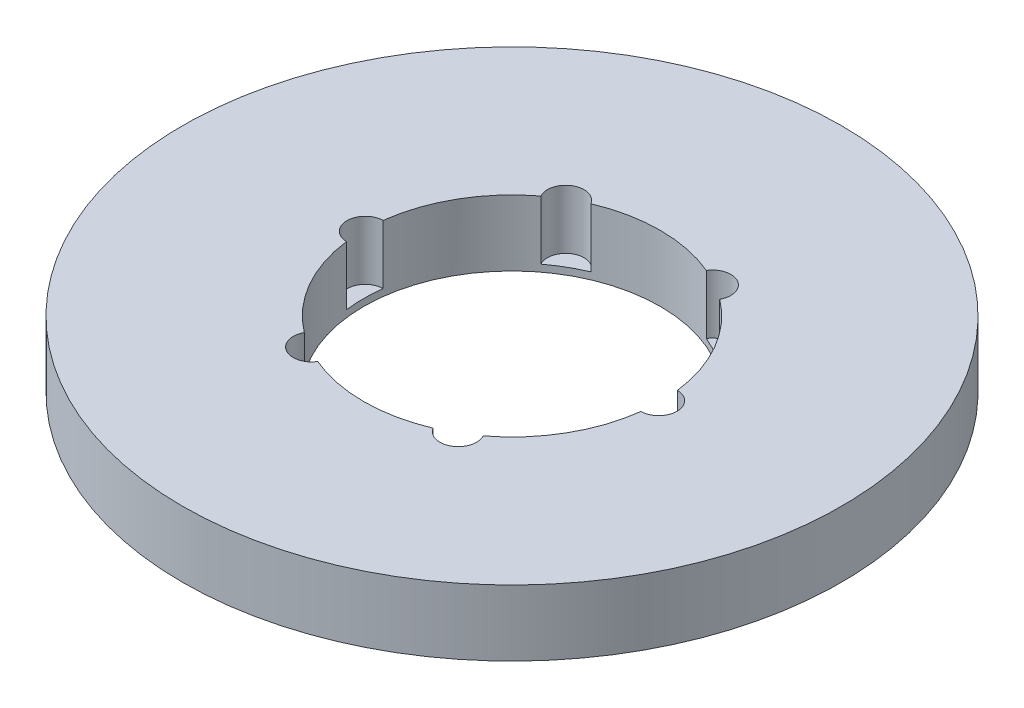
ISO-10303-21;
HEADER;
FILE_DESCRIPTION(('STEP AP214'),'2;1');
FILE_NAME('part.step','',(''),(''),'','','');
FILE_SCHEMA(('AUTOMOTIVE_DESIGN { 1 0 10303 214 1 1 1 1 }'));
ENDSEC;
DATA;
#1=APPLICATION_CONTEXT('core data for automotive mechanical design processes');
#2=APPLICATION_PROTOCOL_DEFINITION('international standard','automotive_design',2000,#1);
#3=PRODUCT_CONTEXT('',#1,'mechanical');
#4=PRODUCT('Part','Part','',(#3));
#5=PRODUCT_RELATED_PRODUCT_CATEGORY('part','',(#4));
#6=PRODUCT_DEFINITION_FORMATION('','',#4);
#7=PRODUCT_DEFINITION_CONTEXT('part definition',#1,'design');
#8=PRODUCT_DEFINITION('design','',#6,#7);
#9=PRODUCT_DEFINITION_SHAPE('','',#8);
#10=(LENGTH_UNIT() NAMED_UNIT(*) SI_UNIT(.MILLI.,.METRE.));
#11=(NAMED_UNIT(*) PLANE_ANGLE_UNIT() SI_UNIT($,.RADIAN.));
#12=(NAMED_UNIT(*) SI_UNIT($,.STERADIAN.) SOLID_ANGLE_UNIT());
#13=UNCERTAINTY_MEASURE_WITH_UNIT(LENGTH_MEASURE(1.E-05),#10,'distance_accuracy_value','');
#14=(GEOMETRIC_REPRESENTATION_CONTEXT(3) GLOBAL_UNCERTAINTY_ASSIGNED_CONTEXT((#13)) GLOBAL_UNIT_ASSIGNED_CONTEXT((#10,
#11,#12)) REPRESENTATION_CONTEXT('',''));
#15=CARTESIAN_POINT('',(0.,0.,0.));
#16=DIRECTION('',(0.,0.,1.));
#17=DIRECTION('',(1.,0.,0.));
#18=AXIS2_PLACEMENT_3D('',#15,#16,#17);
#19=CARTESIAN_POINT('',(0.,10.,0.));
#20=DIRECTION('',(0.,-1.,0.));
#21=DIRECTION('',(0.,0.,-1.));
#22=AXIS2_PLACEMENT_3D('',#19,#20,#21);
#23=CYLINDRICAL_SURFACE('',#22,50.);
#24=CARTESIAN_POINT('',(0.,10.,0.));
#25=DIRECTION('',(0.,1.,0.));
#26=DIRECTION('',(0.,0.,1.));
#27=AXIS2_PLACEMENT_3D('',#24,#25,#26);
#28=CIRCLE('',#27,50.);
#29=CARTESIAN_POINT('',(0.,10.,50.));
#30=VERTEX_POINT('',#29);
#31=EDGE_CURVE('E162',#30,#30,#28,.T.);
#32=ORIENTED_EDGE('',*,*,#31,.F.);
#33=EDGE_LOOP('',(#32));
#34=FACE_BOUND('',#33,.T.);
#35=CARTESIAN_POINT('',(0.,0.,0.));
#36=DIRECTION('',(0.,1.,0.));
#37=DIRECTION('',(0.,0.,1.));
#38=AXIS2_PLACEMENT_3D('',#35,#36,#37);
#39=CIRCLE('',#38,50.);
#40=CARTESIAN_POINT('',(0.,0.,50.));
#41=VERTEX_POINT('',#40);
#42=EDGE_CURVE('E157',#41,#41,#39,.T.);
#43=ORIENTED_EDGE('',*,*,#42,.T.);
#44=EDGE_LOOP('',(#43));
#45=FACE_BOUND('',#44,.T.);
#46=ADVANCED_FACE('F39',(#34,#45),#23,.T.);
#47=CARTESIAN_POINT('',(0.,10.,0.));
#48=DIRECTION('',(0.,1.,0.));
#49=DIRECTION('',(0.,0.,1.));
#50=AXIS2_PLACEMENT_3D('',#47,#48,#49);
#51=PLANE('',#50);
#52=CARTESIAN_POINT('',(-11.1339505884111,10.,-19.2845681080889));
#53=DIRECTION('',(0.,1.,0.));
#54=DIRECTION('',(-0.866025403784433,0.,0.50000000000001));
#55=AXIS2_PLACEMENT_3D('',#52,#53,#54);
#56=CIRCLE('',#55,2.77969819906145);
#57=CARTESIAN_POINT('',(-8.75712561366232,10.,-20.7258956618656));
#58=VERTEX_POINT('',#57);
#59=CARTESIAN_POINT('',(-13.5705893525306,10.,-17.9468410764954));
#60=VERTEX_POINT('',#59);
#61=EDGE_CURVE('E218',#58,#60,#56,.T.);
#62=ORIENTED_EDGE('',*,*,#61,.F.);
#63=CARTESIAN_POINT('',(0.,10.,0.));
#64=DIRECTION('',(0.,1.,0.));
#65=DIRECTION('',(0.,0.,1.));
#66=AXIS2_PLACEMENT_3D('',#63,#64,#65);
#67=CIRCLE('',#66,22.5);
#68=CARTESIAN_POINT('',(8.75712561366188,10.,-20.7258956618658));
#69=VERTEX_POINT('',#68);
#70=EDGE_CURVE('E169',#69,#58,#67,.T.);
#71=ORIENTED_EDGE('',*,*,#70,.F.);
#72=CARTESIAN_POINT('',(11.1339505884107,10.,-19.2845681080892));
#73=DIRECTION('',(0.,1.,0.));
#74=DIRECTION('',(-0.866025403784443,0.,-0.499999999999992));
#75=AXIS2_PLACEMENT_3D('',#72,#73,#74);
#76=CIRCLE('',#75,2.77969819906145);
#77=CARTESIAN_POINT('',(13.5705893525302,10.,-17.9468410764957));
#78=VERTEX_POINT('',#77);
#79=EDGE_CURVE('E285',#78,#69,#76,.T.);
#80=ORIENTED_EDGE('',*,*,#79,.F.);
#81=CARTESIAN_POINT('',(22.3277149661924,10.,-2.77905458537011));
#82=VERTEX_POINT('',#81);
#83=EDGE_CURVE('E174',#82,#78,#67,.T.);
#84=ORIENTED_EDGE('',*,*,#83,.F.);
#85=CARTESIAN_POINT('',(22.2679011768218,10.,0.));
#86=DIRECTION('',(0.,1.,0.));
#87=DIRECTION('',(0.,0.,-1.));
#88=AXIS2_PLACEMENT_3D('',#85,#86,#87);
#89=CIRCLE('',#88,2.77969819906145);
#90=CARTESIAN_POINT('',(22.3277149661924,10.,2.77905458537011));
#91=VERTEX_POINT('',#90);
#92=EDGE_CURVE('E280',#91,#82,#89,.T.);
#93=ORIENTED_EDGE('',*,*,#92,.F.);
#94=CARTESIAN_POINT('',(13.5705893525304,10.,17.9468410764955));
#95=VERTEX_POINT('',#94);
#96=EDGE_CURVE('E164',#95,#91,#67,.T.);
#97=ORIENTED_EDGE('',*,*,#96,.F.);
#98=CARTESIAN_POINT('',(11.133950588411,10.,19.284568108089));
#99=DIRECTION('',(0.,1.,0.));
#100=DIRECTION('',(0.866025403784436,0.,-0.500000000000004));
#101=AXIS2_PLACEMENT_3D('',#98,#99,#100);
#102=CIRCLE('',#101,2.77969819906145);
#103=CARTESIAN_POINT('',(8.75712561366217,10.,20.7258956618657));
#104=VERTEX_POINT('',#103);
#105=EDGE_CURVE('E269',#104,#95,#102,.T.);
#106=ORIENTED_EDGE('',*,*,#105,.F.);
#107=CARTESIAN_POINT('',(-8.75712561366202,10.,20.7258956618657));
#108=VERTEX_POINT('',#107);
#109=EDGE_CURVE('E149',#108,#104,#67,.T.);
#110=ORIENTED_EDGE('',*,*,#109,.F.);
#111=CARTESIAN_POINT('',(-11.1339505884108,10.,19.2845681080891));
#112=DIRECTION('',(0.,1.,0.));
#113=DIRECTION('',(0.86602540378444,0.,0.499999999999998));
#114=AXIS2_PLACEMENT_3D('',#111,#112,#113);
#115=CIRCLE('',#114,2.77969819906145);
#116=CARTESIAN_POINT('',(-13.5705893525303,10.,17.9468410764956));
#117=VERTEX_POINT('',#116);
#118=EDGE_CURVE('E128',#117,#108,#115,.T.);
#119=ORIENTED_EDGE('',*,*,#118,.F.);
#120=CARTESIAN_POINT('',(-22.3277149661924,10.,2.77905458537011));
#121=VERTEX_POINT('',#120);
#122=EDGE_CURVE('E148',#121,#117,#67,.T.);
#123=ORIENTED_EDGE('',*,*,#122,.F.);
#124=CARTESIAN_POINT('',(-22.2679011768218,10.,0.));
#125=DIRECTION('',(0.,1.,0.));
#126=DIRECTION('',(0.,0.,1.));
#127=AXIS2_PLACEMENT_3D('',#124,#125,#126);
#128=CIRCLE('',#127,2.77969819906145);
#129=CARTESIAN_POINT('',(-22.3277149661924,10.,-2.77905458537011));
#130=VERTEX_POINT('',#129);
#131=EDGE_CURVE('E179',#130,#121,#128,.T.);
#132=ORIENTED_EDGE('',*,*,#131,.F.);
#133=EDGE_CURVE('E161',#60,#130,#67,.T.);
#134=ORIENTED_EDGE('',*,*,#133,.F.);
#135=EDGE_LOOP('',(#62,#71,#80,#84,#93,#97,#106,#110,#119,#123,#132,#134));
#136=FACE_BOUND('',#135,.T.);
#137=ORIENTED_EDGE('',*,*,#31,.T.);
#138=EDGE_LOOP('',(#137));
#139=FACE_BOUND('',#138,.T.);
#140=ADVANCED_FACE('F141',(#136,#139),#51,.T.);
#141=CARTESIAN_POINT('',(0.,0.,0.));
#142=DIRECTION('',(0.,1.,0.));
#143=DIRECTION('',(0.,0.,1.));
#144=AXIS2_PLACEMENT_3D('',#141,#142,#143);
#145=PLANE('',#144);
#146=CARTESIAN_POINT('',(0.,0.,0.));
#147=DIRECTION('',(0.,1.,0.));
#148=DIRECTION('',(0.,0.,1.));
#149=AXIS2_PLACEMENT_3D('',#146,#147,#148);
#150=CIRCLE('',#149,22.5);
#151=CARTESIAN_POINT('',(0.,0.,22.5));
#152=VERTEX_POINT('',#151);
#153=EDGE_CURVE('E166',#152,#152,#150,.T.);
#154=ORIENTED_EDGE('',*,*,#153,.T.);
#155=EDGE_LOOP('',(#154));
#156=FACE_BOUND('',#155,.T.);
#157=ORIENTED_EDGE('',*,*,#42,.F.);
#158=EDGE_LOOP('',(#157));
#159=FACE_BOUND('',#158,.T.);
#160=ADVANCED_FACE('F234',(#156,#159),#145,.F.);
#161=CARTESIAN_POINT('',(0.,10.,0.));
#162=DIRECTION('',(0.,-1.,0.));
#163=DIRECTION('',(0.,0.,-1.));
#164=AXIS2_PLACEMENT_3D('',#161,#162,#163);
#165=CYLINDRICAL_SURFACE('',#164,22.5);
#166=DIRECTION('',(0.,1.,0.));
#167=VECTOR('',#166,1.);
#168=CARTESIAN_POINT('',(-8.75712561366231,5.52484472801074,-20.7258956618656));
#169=LINE('',#168,#167);
#170=CARTESIAN_POINT('',(-8.75712561366232,1.04968945602148,-20.7258956618656));
#171=VERTEX_POINT('',#170);
#172=EDGE_CURVE('E11',#171,#58,#169,.T.);
#173=ORIENTED_EDGE('',*,*,#172,.F.);
#174=CARTESIAN_POINT('',(0.,1.04968945602148,0.));
#175=DIRECTION('',(0.,1.,0.));
#176=DIRECTION('',(0.,0.,1.));
#177=AXIS2_PLACEMENT_3D('',#174,#175,#176);
#178=CIRCLE('',#177,22.5);
#179=CARTESIAN_POINT('',(-13.5705893525306,1.04968945602148,-17.9468410764954));
#180=VERTEX_POINT('',#179);
#181=EDGE_CURVE('E214',#171,#180,#178,.T.);
#182=ORIENTED_EDGE('',*,*,#181,.T.);
#183=DIRECTION('',(0.,1.,0.));
#184=VECTOR('',#183,1.);
#185=CARTESIAN_POINT('',(-13.5705893525306,5.52484472801074,-17.9468410764954));
#186=LINE('',#185,#184);
#187=EDGE_CURVE('E46',#60,#180,#186,.F.);
#188=ORIENTED_EDGE('',*,*,#187,.F.);
#189=ORIENTED_EDGE('',*,*,#133,.T.);
#190=DIRECTION('',(0.,1.,0.));
#191=VECTOR('',#190,1.);
#192=CARTESIAN_POINT('',(-22.3277149661924,5.52484472801074,-2.77905458537011));
#193=LINE('',#192,#191);
#194=CARTESIAN_POINT('',(-22.3277149661924,1.04968945602148,-2.77905458537011));
#195=VERTEX_POINT('',#194);
#196=EDGE_CURVE('E187',#195,#130,#193,.T.);
#197=ORIENTED_EDGE('',*,*,#196,.F.);
#198=CARTESIAN_POINT('',(0.,1.04968945602148,0.));
#199=DIRECTION('',(0.,1.,0.));
#200=DIRECTION('',(0.,0.,1.));
#201=AXIS2_PLACEMENT_3D('',#198,#199,#200);
#202=CIRCLE('',#201,22.5);
#203=CARTESIAN_POINT('',(-22.3277149661924,1.04968945602148,2.77905458537011));
#204=VERTEX_POINT('',#203);
#205=EDGE_CURVE('E184',#195,#204,#202,.T.);
#206=ORIENTED_EDGE('',*,*,#205,.T.);
#207=DIRECTION('',(0.,1.,0.));
#208=VECTOR('',#207,1.);
#209=CARTESIAN_POINT('',(-22.3277149661924,5.52484472801074,2.77905458537011));
#210=LINE('',#209,#208);
#211=EDGE_CURVE('E158',#121,#204,#210,.F.);
#212=ORIENTED_EDGE('',*,*,#211,.F.);
#213=ORIENTED_EDGE('',*,*,#122,.T.);
#214=DIRECTION('',(0.,1.,0.));
#215=VECTOR('',#214,1.);
#216=CARTESIAN_POINT('',(-13.5705893525303,5.52484472801074,17.9468410764956));
#217=LINE('',#216,#215);
#218=CARTESIAN_POINT('',(-13.5705893525303,1.04968945602148,17.9468410764956));
#219=VERTEX_POINT('',#218);
#220=EDGE_CURVE('E127',#219,#117,#217,.T.);
#221=ORIENTED_EDGE('',*,*,#220,.F.);
#222=CARTESIAN_POINT('',(0.,1.04968945602148,0.));
#223=DIRECTION('',(0.,1.,0.));
#224=DIRECTION('',(0.,0.,1.));
#225=AXIS2_PLACEMENT_3D('',#222,#223,#224);
#226=CIRCLE('',#225,22.5);
#227=CARTESIAN_POINT('',(-8.75712561366202,1.04968945602148,20.7258956618657));
#228=VERTEX_POINT('',#227);
#229=EDGE_CURVE('E189',#219,#228,#226,.T.);
#230=ORIENTED_EDGE('',*,*,#229,.T.);
#231=DIRECTION('',(0.,1.,0.));
#232=VECTOR('',#231,1.);
#233=CARTESIAN_POINT('',(-8.75712561366202,5.52484472801074,20.7258956618657));
#234=LINE('',#233,#232);
#235=EDGE_CURVE('E140',#108,#228,#234,.F.);
#236=ORIENTED_EDGE('',*,*,#235,.F.);
#237=ORIENTED_EDGE('',*,*,#109,.T.);
#238=DIRECTION('',(0.,1.,0.));
#239=VECTOR('',#238,1.);
#240=CARTESIAN_POINT('',(8.75712561366217,5.52484472801074,20.7258956618657));
#241=LINE('',#240,#239);
#242=CARTESIAN_POINT('',(8.75712561366217,1.04968945602148,20.7258956618657));
#243=VERTEX_POINT('',#242);
#244=EDGE_CURVE('E196',#243,#104,#241,.T.);
#245=ORIENTED_EDGE('',*,*,#244,.F.);
#246=CARTESIAN_POINT('',(0.,1.04968945602148,0.));
#247=DIRECTION('',(0.,1.,0.));
#248=DIRECTION('',(0.,0.,1.));
#249=AXIS2_PLACEMENT_3D('',#246,#247,#248);
#250=CIRCLE('',#249,22.5);
#251=CARTESIAN_POINT('',(13.5705893525304,1.04968945602148,17.9468410764955));
#252=VERTEX_POINT('',#251);
#253=EDGE_CURVE('E136',#243,#252,#250,.T.);
#254=ORIENTED_EDGE('',*,*,#253,.T.);
#255=DIRECTION('',(0.,1.,0.));
#256=VECTOR('',#255,1.);
#257=CARTESIAN_POINT('',(13.5705893525304,5.52484472801074,17.9468410764955));
#258=LINE('',#257,#256);
#259=EDGE_CURVE('E194',#95,#252,#258,.F.);
#260=ORIENTED_EDGE('',*,*,#259,.F.);
#261=ORIENTED_EDGE('',*,*,#96,.T.);
#262=DIRECTION('',(0.,1.,0.));
#263=VECTOR('',#262,1.);
#264=CARTESIAN_POINT('',(22.3277149661924,5.52484472801074,2.77905458537011));
#265=LINE('',#264,#263);
#266=CARTESIAN_POINT('',(22.3277149661924,1.04968945602148,2.77905458537011));
#267=VERTEX_POINT('',#266);
#268=EDGE_CURVE('E206',#267,#91,#265,.T.);
#269=ORIENTED_EDGE('',*,*,#268,.F.);
#270=CARTESIAN_POINT('',(0.,1.04968945602148,0.));
#271=DIRECTION('',(0.,1.,0.));
#272=DIRECTION('',(0.,0.,1.));
#273=AXIS2_PLACEMENT_3D('',#270,#271,#272);
#274=CIRCLE('',#273,22.5);
#275=CARTESIAN_POINT('',(22.3277149661924,1.04968945602148,-2.77905458537011));
#276=VERTEX_POINT('',#275);
#277=EDGE_CURVE('E199',#267,#276,#274,.T.);
#278=ORIENTED_EDGE('',*,*,#277,.T.);
#279=DIRECTION('',(0.,1.,0.));
#280=VECTOR('',#279,1.);
#281=CARTESIAN_POINT('',(22.3277149661924,5.52484472801074,-2.77905458537011));
#282=LINE('',#281,#280);
#283=EDGE_CURVE('E201',#82,#276,#282,.F.);
#284=ORIENTED_EDGE('',*,*,#283,.F.);
#285=ORIENTED_EDGE('',*,*,#83,.T.);
#286=DIRECTION('',(0.,1.,0.));
#287=VECTOR('',#286,1.);
#288=CARTESIAN_POINT('',(13.5705893525302,5.52484472801074,-17.9468410764957));
#289=LINE('',#288,#287);
#290=CARTESIAN_POINT('',(13.5705893525302,1.04968945602148,-17.9468410764957));
#291=VERTEX_POINT('',#290);
#292=EDGE_CURVE('E213',#291,#78,#289,.T.);
#293=ORIENTED_EDGE('',*,*,#292,.F.);
#294=CARTESIAN_POINT('',(0.,1.04968945602148,0.));
#295=DIRECTION('',(0.,1.,0.));
#296=DIRECTION('',(0.,0.,1.));
#297=AXIS2_PLACEMENT_3D('',#294,#295,#296);
#298=CIRCLE('',#297,22.5);
#299=CARTESIAN_POINT('',(8.75712561366188,1.04968945602148,-20.7258956618658));
#300=VERTEX_POINT('',#299);
#301=EDGE_CURVE('E208',#291,#300,#298,.T.);
#302=ORIENTED_EDGE('',*,*,#301,.T.);
#303=DIRECTION('',(0.,1.,0.));
#304=VECTOR('',#303,1.);
#305=CARTESIAN_POINT('',(8.75712561366188,5.52484472801074,-20.7258956618658));
#306=LINE('',#305,#304);
#307=EDGE_CURVE('E211',#69,#300,#306,.F.);
#308=ORIENTED_EDGE('',*,*,#307,.F.);
#309=ORIENTED_EDGE('',*,*,#70,.T.);
#310=EDGE_LOOP('',(#173,#182,#188,#189,#197,#206,#212,#213,#221,#230,#236,#237,#245,#254,#260,
#261,#269,#278,#284,#285,#293,#302,#308,#309));
#311=FACE_BOUND('',#310,.T.);
#312=ORIENTED_EDGE('',*,*,#153,.F.);
#313=EDGE_LOOP('',(#312));
#314=FACE_BOUND('',#313,.T.);
#315=ADVANCED_FACE('F152',(#311,#314),#165,.F.);
#316=CARTESIAN_POINT('',(-22.2679011768218,1.04968945602148,0.));
#317=DIRECTION('',(0.,1.,0.));
#318=DIRECTION('',(0.,0.,1.));
#319=AXIS2_PLACEMENT_3D('',#316,#317,#318);
#320=CYLINDRICAL_SURFACE('',#319,2.77969819906145);
#321=ORIENTED_EDGE('',*,*,#196,.T.);
#322=ORIENTED_EDGE('',*,*,#131,.T.);
#323=ORIENTED_EDGE('',*,*,#211,.T.);
#324=CARTESIAN_POINT('',(-22.2679011768218,1.04968945602148,0.));
#325=DIRECTION('',(0.,1.,0.));
#326=DIRECTION('',(0.,0.,1.));
#327=AXIS2_PLACEMENT_3D('',#324,#325,#326);
#328=CIRCLE('',#327,2.77969819906145);
#329=EDGE_CURVE('E180',#195,#204,#328,.T.);
#330=ORIENTED_EDGE('',*,*,#329,.F.);
#331=EDGE_LOOP('',(#321,#322,#323,#330));
#332=FACE_BOUND('',#331,.T.);
#333=ADVANCED_FACE('F244',(#332),#320,.F.);
#334=CARTESIAN_POINT('',(-22.2679011768218,1.04968945602148,0.));
#335=DIRECTION('',(0.,1.,0.));
#336=DIRECTION('',(0.,0.,1.));
#337=AXIS2_PLACEMENT_3D('',#334,#335,#336);
#338=PLANE('',#337);
#339=ORIENTED_EDGE('',*,*,#329,.T.);
#340=ORIENTED_EDGE('',*,*,#205,.F.);
#341=EDGE_LOOP('',(#339,#340));
#342=FACE_BOUND('',#341,.T.);
#343=ADVANCED_FACE('F248',(#342),#338,.T.);
#344=CARTESIAN_POINT('',(-11.1339505884108,1.04968945602148,19.2845681080891));
#345=DIRECTION('',(0.,1.,0.));
#346=DIRECTION('',(0.,0.,1.));
#347=AXIS2_PLACEMENT_3D('',#344,#345,#346);
#348=CYLINDRICAL_SURFACE('',#347,2.77969819906145);
#349=ORIENTED_EDGE('',*,*,#220,.T.);
#350=ORIENTED_EDGE('',*,*,#118,.T.);
#351=ORIENTED_EDGE('',*,*,#235,.T.);
#352=CARTESIAN_POINT('',(-11.1339505884108,1.04968945602148,19.2845681080891));
#353=DIRECTION('',(0.,1.,0.));
#354=DIRECTION('',(0.86602540378444,0.,0.499999999999998));
#355=AXIS2_PLACEMENT_3D('',#352,#353,#354);
#356=CIRCLE('',#355,2.77969819906145);
#357=EDGE_CURVE('E135',#219,#228,#356,.T.);
#358=ORIENTED_EDGE('',*,*,#357,.F.);
#359=EDGE_LOOP('',(#349,#350,#351,#358));
#360=FACE_BOUND('',#359,.T.);
#361=ADVANCED_FACE('F126',(#360),#348,.F.);
#362=CARTESIAN_POINT('',(-11.1339505884108,1.04968945602148,19.2845681080891));
#363=DIRECTION('',(0.,1.,0.));
#364=DIRECTION('',(0.86602540378444,0.,0.499999999999998));
#365=AXIS2_PLACEMENT_3D('',#362,#363,#364);
#366=PLANE('',#365);
#367=ORIENTED_EDGE('',*,*,#357,.T.);
#368=ORIENTED_EDGE('',*,*,#229,.F.);
#369=EDGE_LOOP('',(#367,#368));
#370=FACE_BOUND('',#369,.T.);
#371=ADVANCED_FACE('F258',(#370),#366,.T.);
#372=CARTESIAN_POINT('',(11.133950588411,1.04968945602148,19.284568108089));
#373=DIRECTION('',(0.,1.,0.));
#374=DIRECTION('',(0.,0.,1.));
#375=AXIS2_PLACEMENT_3D('',#372,#373,#374);
#376=CYLINDRICAL_SURFACE('',#375,2.77969819906145);
#377=ORIENTED_EDGE('',*,*,#244,.T.);
#378=ORIENTED_EDGE('',*,*,#105,.T.);
#379=ORIENTED_EDGE('',*,*,#259,.T.);
#380=CARTESIAN_POINT('',(11.133950588411,1.04968945602148,19.284568108089));
#381=DIRECTION('',(0.,1.,0.));
#382=DIRECTION('',(0.866025403784436,0.,-0.500000000000004));
#383=AXIS2_PLACEMENT_3D('',#380,#381,#382);
#384=CIRCLE('',#383,2.77969819906145);
#385=EDGE_CURVE('E147',#243,#252,#384,.T.);
#386=ORIENTED_EDGE('',*,*,#385,.F.);
#387=EDGE_LOOP('',(#377,#378,#379,#386));
#388=FACE_BOUND('',#387,.T.);
#389=ADVANCED_FACE('F256',(#388),#376,.F.);
#390=CARTESIAN_POINT('',(11.133950588411,1.04968945602148,19.284568108089));
#391=DIRECTION('',(0.,1.,0.));
#392=DIRECTION('',(0.866025403784436,0.,-0.500000000000004));
#393=AXIS2_PLACEMENT_3D('',#390,#391,#392);
#394=PLANE('',#393);
#395=ORIENTED_EDGE('',*,*,#385,.T.);
#396=ORIENTED_EDGE('',*,*,#253,.F.);
#397=EDGE_LOOP('',(#395,#396));
#398=FACE_BOUND('',#397,.T.);
#399=ADVANCED_FACE('F263',(#398),#394,.T.);
#400=CARTESIAN_POINT('',(22.2679011768218,1.04968945602148,0.));
#401=DIRECTION('',(0.,1.,0.));
#402=DIRECTION('',(0.,0.,1.));
#403=AXIS2_PLACEMENT_3D('',#400,#401,#402);
#404=CYLINDRICAL_SURFACE('',#403,2.77969819906145);
#405=ORIENTED_EDGE('',*,*,#268,.T.);
#406=ORIENTED_EDGE('',*,*,#92,.T.);
#407=ORIENTED_EDGE('',*,*,#283,.T.);
#408=CARTESIAN_POINT('',(22.2679011768218,1.04968945602148,0.));
#409=DIRECTION('',(0.,1.,0.));
#410=DIRECTION('',(0.,0.,-1.));
#411=AXIS2_PLACEMENT_3D('',#408,#409,#410);
#412=CIRCLE('',#411,2.77969819906145);
#413=EDGE_CURVE('E273',#267,#276,#412,.T.);
#414=ORIENTED_EDGE('',*,*,#413,.F.);
#415=EDGE_LOOP('',(#405,#406,#407,#414));
#416=FACE_BOUND('',#415,.T.);
#417=ADVANCED_FACE('F297',(#416),#404,.F.);
#418=CARTESIAN_POINT('',(22.2679011768218,1.04968945602148,0.));
#419=DIRECTION('',(0.,1.,0.));
#420=DIRECTION('',(0.,0.,-1.));
#421=AXIS2_PLACEMENT_3D('',#418,#419,#420);
#422=PLANE('',#421);
#423=ORIENTED_EDGE('',*,*,#413,.T.);
#424=ORIENTED_EDGE('',*,*,#277,.F.);
#425=EDGE_LOOP('',(#423,#424));
#426=FACE_BOUND('',#425,.T.);
#427=ADVANCED_FACE('F299',(#426),#422,.T.);
#428=CARTESIAN_POINT('',(11.1339505884107,1.04968945602148,-19.2845681080892));
#429=DIRECTION('',(0.,1.,0.));
#430=DIRECTION('',(0.,0.,1.));
#431=AXIS2_PLACEMENT_3D('',#428,#429,#430);
#432=CYLINDRICAL_SURFACE('',#431,2.77969819906145);
#433=ORIENTED_EDGE('',*,*,#292,.T.);
#434=ORIENTED_EDGE('',*,*,#79,.T.);
#435=ORIENTED_EDGE('',*,*,#307,.T.);
#436=CARTESIAN_POINT('',(11.1339505884107,1.04968945602148,-19.2845681080892));
#437=DIRECTION('',(0.,1.,0.));
#438=DIRECTION('',(-0.866025403784443,0.,-0.499999999999992));
#439=AXIS2_PLACEMENT_3D('',#436,#437,#438);
#440=CIRCLE('',#439,2.77969819906145);
#441=EDGE_CURVE('E56',#291,#300,#440,.T.);
#442=ORIENTED_EDGE('',*,*,#441,.F.);
#443=EDGE_LOOP('',(#433,#434,#435,#442));
#444=FACE_BOUND('',#443,.T.);
#445=ADVANCED_FACE('F292',(#444),#432,.F.);
#446=CARTESIAN_POINT('',(11.1339505884107,1.04968945602148,-19.2845681080892));
#447=DIRECTION('',(0.,1.,0.));
#448=DIRECTION('',(-0.866025403784443,0.,-0.499999999999992));
#449=AXIS2_PLACEMENT_3D('',#446,#447,#448);
#450=PLANE('',#449);
#451=ORIENTED_EDGE('',*,*,#441,.T.);
#452=ORIENTED_EDGE('',*,*,#301,.F.);
#453=EDGE_LOOP('',(#451,#452));
#454=FACE_BOUND('',#453,.T.);
#455=ADVANCED_FACE('F226',(#454),#450,.T.);
#456=CARTESIAN_POINT('',(-11.1339505884111,1.04968945602148,-19.2845681080889));
#457=DIRECTION('',(0.,1.,0.));
#458=DIRECTION('',(0.,0.,1.));
#459=AXIS2_PLACEMENT_3D('',#456,#457,#458);
#460=CYLINDRICAL_SURFACE('',#459,2.77969819906145);
#461=ORIENTED_EDGE('',*,*,#172,.T.);
#462=ORIENTED_EDGE('',*,*,#61,.T.);
#463=ORIENTED_EDGE('',*,*,#187,.T.);
#464=CARTESIAN_POINT('',(-11.1339505884111,1.04968945602148,-19.2845681080889));
#465=DIRECTION('',(0.,1.,0.));
#466=DIRECTION('',(-0.866025403784433,0.,0.50000000000001));
#467=AXIS2_PLACEMENT_3D('',#464,#465,#466);
#468=CIRCLE('',#467,2.77969819906145);
#469=EDGE_CURVE('E55',#171,#180,#468,.T.);
#470=ORIENTED_EDGE('',*,*,#469,.F.);
#471=EDGE_LOOP('',(#461,#462,#463,#470));
#472=FACE_BOUND('',#471,.T.);
#473=ADVANCED_FACE('F217',(#472),#460,.F.);
#474=CARTESIAN_POINT('',(-11.1339505884111,1.04968945602148,-19.2845681080889));
#475=DIRECTION('',(0.,1.,0.));
#476=DIRECTION('',(-0.866025403784433,0.,0.50000000000001));
#477=AXIS2_PLACEMENT_3D('',#474,#475,#476);
#478=PLANE('',#477);
#479=ORIENTED_EDGE('',*,*,#469,.T.);
#480=ORIENTED_EDGE('',*,*,#181,.F.);
#481=EDGE_LOOP('',(#479,#480));
#482=FACE_BOUND('',#481,.T.);
#483=ADVANCED_FACE('F219',(#482),#478,.T.);
#484=CLOSED_SHELL('',(#46,#140,#160,#315,#333,#343,#361,#371,#389,#399,#417,#427,#445,#455,#473,#483));
#485=MANIFOLD_SOLID_BREP('B2',#484);
#486=ADVANCED_BREP_SHAPE_REPRESENTATION('',(#18,#485),#14);
#487=SHAPE_DEFINITION_REPRESENTATION(#9,#486);
ENDSEC;
END-ISO-10303-21;
